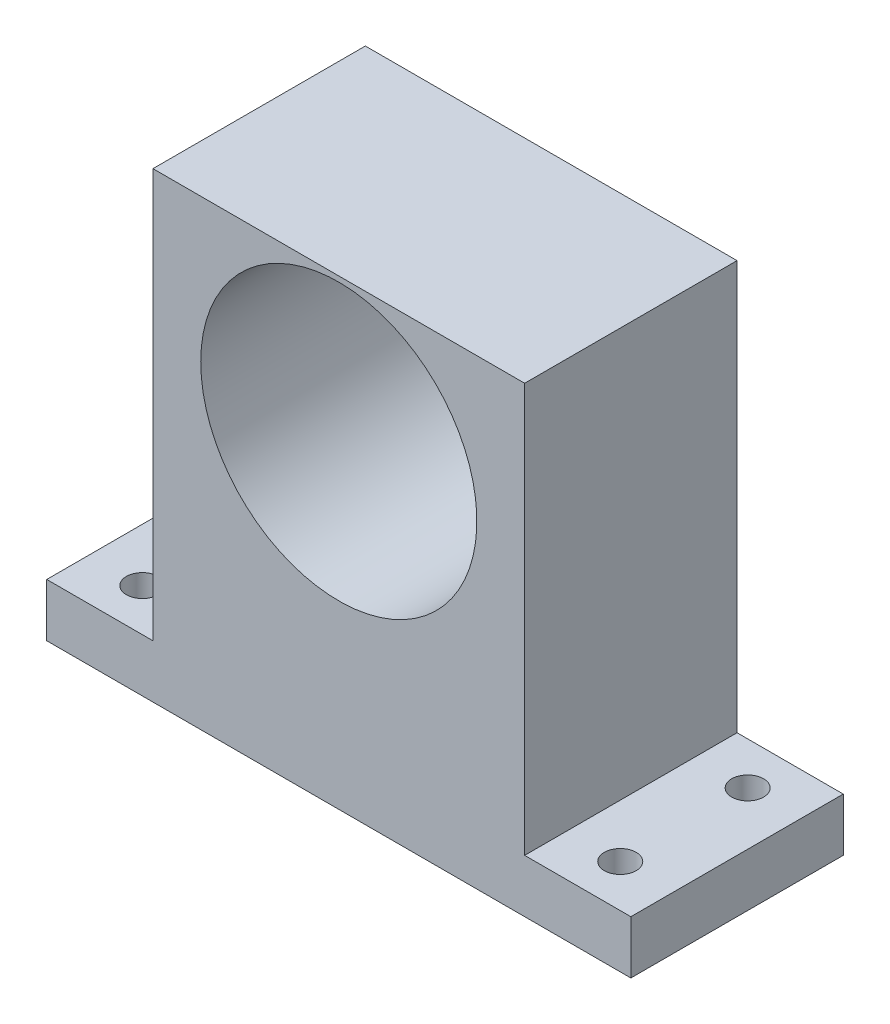
ISO-10303-21;
HEADER;
FILE_DESCRIPTION(('STEP AP214'),'2;1');
FILE_NAME('part.step','',(''),(''),'','','');
FILE_SCHEMA(('AUTOMOTIVE_DESIGN { 1 0 10303 214 1 1 1 1 }'));
ENDSEC;
DATA;
#1=APPLICATION_CONTEXT('core data for automotive mechanical design processes');
#2=APPLICATION_PROTOCOL_DEFINITION('international standard','automotive_design',2000,#1);
#3=PRODUCT_CONTEXT('',#1,'mechanical');
#4=PRODUCT('Part','Part','',(#3));
#5=PRODUCT_RELATED_PRODUCT_CATEGORY('part','',(#4));
#6=PRODUCT_DEFINITION_FORMATION('','',#4);
#7=PRODUCT_DEFINITION_CONTEXT('part definition',#1,'design');
#8=PRODUCT_DEFINITION('design','',#6,#7);
#9=PRODUCT_DEFINITION_SHAPE('','',#8);
#10=(LENGTH_UNIT() NAMED_UNIT(*) SI_UNIT(.MILLI.,.METRE.));
#11=(NAMED_UNIT(*) PLANE_ANGLE_UNIT() SI_UNIT($,.RADIAN.));
#12=(NAMED_UNIT(*) SI_UNIT($,.STERADIAN.) SOLID_ANGLE_UNIT());
#13=UNCERTAINTY_MEASURE_WITH_UNIT(LENGTH_MEASURE(1.E-05),#10,'distance_accuracy_value','');
#14=(GEOMETRIC_REPRESENTATION_CONTEXT(3) GLOBAL_UNCERTAINTY_ASSIGNED_CONTEXT((#13)) GLOBAL_UNIT_ASSIGNED_CONTEXT((#10,
#11,#12)) REPRESENTATION_CONTEXT('',''));
#15=CARTESIAN_POINT('',(0.,0.,0.));
#16=DIRECTION('',(0.,0.,1.));
#17=DIRECTION('',(1.,0.,0.));
#18=AXIS2_PLACEMENT_3D('',#15,#16,#17);
#19=CARTESIAN_POINT('',(-17.5,-21.75,20.));
#20=DIRECTION('',(1.,0.,0.));
#21=DIRECTION('',(0.,0.,-1.));
#22=AXIS2_PLACEMENT_3D('',#19,#20,#21);
#23=PLANE('',#22);
#24=DIRECTION('',(0.,0.,-1.));
#25=VECTOR('',#24,1.);
#26=CARTESIAN_POINT('',(-17.5,-16.75,0.));
#27=LINE('',#26,#25);
#28=CARTESIAN_POINT('',(-17.5,-16.75,20.));
#29=VERTEX_POINT('',#28);
#30=CARTESIAN_POINT('',(-17.5,-16.75,0.));
#31=VERTEX_POINT('',#30);
#32=EDGE_CURVE('E48',#29,#31,#27,.T.);
#33=ORIENTED_EDGE('',*,*,#32,.F.);
#34=DIRECTION('',(0.,-1.,0.));
#35=VECTOR('',#34,1.);
#36=CARTESIAN_POINT('',(-17.5,-21.75,20.));
#37=LINE('',#36,#35);
#38=CARTESIAN_POINT('',(-17.5,21.75,20.));
#39=VERTEX_POINT('',#38);
#40=EDGE_CURVE('E158',#39,#29,#37,.T.);
#41=ORIENTED_EDGE('',*,*,#40,.F.);
#42=DIRECTION('',(0.,0.,-1.));
#43=VECTOR('',#42,1.);
#44=CARTESIAN_POINT('',(-17.5,21.75,20.));
#45=LINE('',#44,#43);
#46=CARTESIAN_POINT('',(-17.5,21.75,0.));
#47=VERTEX_POINT('',#46);
#48=EDGE_CURVE('E41',#39,#47,#45,.T.);
#49=ORIENTED_EDGE('',*,*,#48,.T.);
#50=DIRECTION('',(0.,-1.,0.));
#51=VECTOR('',#50,1.);
#52=CARTESIAN_POINT('',(-17.5,-21.75,0.));
#53=LINE('',#52,#51);
#54=EDGE_CURVE('E111',#47,#31,#53,.T.);
#55=ORIENTED_EDGE('',*,*,#54,.T.);
#56=EDGE_LOOP('',(#33,#41,#49,#55));
#57=FACE_BOUND('',#56,.T.);
#58=ADVANCED_FACE('F33',(#57),#23,.F.);
#59=CARTESIAN_POINT('',(17.5,-21.75,20.));
#60=DIRECTION('',(-1.,0.,0.));
#61=DIRECTION('',(0.,0.,1.));
#62=AXIS2_PLACEMENT_3D('',#59,#60,#61);
#63=PLANE('',#62);
#64=DIRECTION('',(0.,0.,1.));
#65=VECTOR('',#64,1.);
#66=CARTESIAN_POINT('',(17.5,-16.75,20.));
#67=LINE('',#66,#65);
#68=CARTESIAN_POINT('',(17.5,-16.75,0.));
#69=VERTEX_POINT('',#68);
#70=CARTESIAN_POINT('',(17.5,-16.75,20.));
#71=VERTEX_POINT('',#70);
#72=EDGE_CURVE('E56',#69,#71,#67,.T.);
#73=ORIENTED_EDGE('',*,*,#72,.F.);
#74=DIRECTION('',(0.,1.,0.));
#75=VECTOR('',#74,1.);
#76=CARTESIAN_POINT('',(17.5,-21.75,0.));
#77=LINE('',#76,#75);
#78=CARTESIAN_POINT('',(17.5,21.75,0.));
#79=VERTEX_POINT('',#78);
#80=EDGE_CURVE('E154',#69,#79,#77,.T.);
#81=ORIENTED_EDGE('',*,*,#80,.T.);
#82=DIRECTION('',(0.,0.,-1.));
#83=VECTOR('',#82,1.);
#84=CARTESIAN_POINT('',(17.5,21.75,20.));
#85=LINE('',#84,#83);
#86=CARTESIAN_POINT('',(17.5,21.75,20.));
#87=VERTEX_POINT('',#86);
#88=EDGE_CURVE('E11',#87,#79,#85,.T.);
#89=ORIENTED_EDGE('',*,*,#88,.F.);
#90=DIRECTION('',(0.,1.,0.));
#91=VECTOR('',#90,1.);
#92=CARTESIAN_POINT('',(17.5,-21.75,20.));
#93=LINE('',#92,#91);
#94=EDGE_CURVE('E110',#71,#87,#93,.T.);
#95=ORIENTED_EDGE('',*,*,#94,.F.);
#96=EDGE_LOOP('',(#73,#81,#89,#95));
#97=FACE_BOUND('',#96,.T.);
#98=ADVANCED_FACE('F35',(#97),#63,.F.);
#99=CARTESIAN_POINT('',(-17.5,21.75,20.));
#100=DIRECTION('',(0.,-1.,0.));
#101=DIRECTION('',(0.,0.,-1.));
#102=AXIS2_PLACEMENT_3D('',#99,#100,#101);
#103=PLANE('',#102);
#104=DIRECTION('',(-1.,0.,0.));
#105=VECTOR('',#104,1.);
#106=CARTESIAN_POINT('',(-17.5,21.75,0.));
#107=LINE('',#106,#105);
#108=EDGE_CURVE('E162',#79,#47,#107,.T.);
#109=ORIENTED_EDGE('',*,*,#108,.T.);
#110=ORIENTED_EDGE('',*,*,#48,.F.);
#111=DIRECTION('',(-1.,0.,0.));
#112=VECTOR('',#111,1.);
#113=CARTESIAN_POINT('',(-17.5,21.75,20.));
#114=LINE('',#113,#112);
#115=EDGE_CURVE('E156',#87,#39,#114,.T.);
#116=ORIENTED_EDGE('',*,*,#115,.F.);
#117=ORIENTED_EDGE('',*,*,#88,.T.);
#118=EDGE_LOOP('',(#109,#110,#116,#117));
#119=FACE_BOUND('',#118,.T.);
#120=ADVANCED_FACE('F176',(#119),#103,.F.);
#121=CARTESIAN_POINT('',(-17.5,-21.75,20.));
#122=DIRECTION('',(0.,1.,0.));
#123=DIRECTION('',(0.,0.,1.));
#124=AXIS2_PLACEMENT_3D('',#121,#122,#123);
#125=PLANE('',#124);
#126=CARTESIAN_POINT('',(-22.5,-21.75,4.));
#127=DIRECTION('',(0.,1.,0.));
#128=DIRECTION('',(0.,0.,1.));
#129=AXIS2_PLACEMENT_3D('',#126,#127,#128);
#130=CIRCLE('',#129,1.5);
#131=CARTESIAN_POINT('',(-22.5,-21.75,5.5));
#132=VERTEX_POINT('',#131);
#133=EDGE_CURVE('E214',#132,#132,#130,.T.);
#134=ORIENTED_EDGE('',*,*,#133,.T.);
#135=EDGE_LOOP('',(#134));
#136=FACE_BOUND('',#135,.T.);
#137=CARTESIAN_POINT('',(22.5,-21.75,16.));
#138=DIRECTION('',(0.,1.,0.));
#139=DIRECTION('',(0.,0.,1.));
#140=AXIS2_PLACEMENT_3D('',#137,#138,#139);
#141=CIRCLE('',#140,1.5);
#142=CARTESIAN_POINT('',(22.5,-21.75,17.5));
#143=VERTEX_POINT('',#142);
#144=EDGE_CURVE('E218',#143,#143,#141,.T.);
#145=ORIENTED_EDGE('',*,*,#144,.T.);
#146=EDGE_LOOP('',(#145));
#147=FACE_BOUND('',#146,.T.);
#148=CARTESIAN_POINT('',(22.5,-21.75,4.));
#149=DIRECTION('',(0.,1.,0.));
#150=DIRECTION('',(0.,0.,1.));
#151=AXIS2_PLACEMENT_3D('',#148,#149,#150);
#152=CIRCLE('',#151,1.5);
#153=CARTESIAN_POINT('',(22.5,-21.75,5.5));
#154=VERTEX_POINT('',#153);
#155=EDGE_CURVE('E222',#154,#154,#152,.T.);
#156=ORIENTED_EDGE('',*,*,#155,.T.);
#157=EDGE_LOOP('',(#156));
#158=FACE_BOUND('',#157,.T.);
#159=CARTESIAN_POINT('',(-22.5,-21.75,16.));
#160=DIRECTION('',(0.,1.,0.));
#161=DIRECTION('',(0.,0.,1.));
#162=AXIS2_PLACEMENT_3D('',#159,#160,#161);
#163=CIRCLE('',#162,1.5);
#164=CARTESIAN_POINT('',(-22.5,-21.75,17.5));
#165=VERTEX_POINT('',#164);
#166=EDGE_CURVE('E126',#165,#165,#163,.T.);
#167=ORIENTED_EDGE('',*,*,#166,.T.);
#168=EDGE_LOOP('',(#167));
#169=FACE_BOUND('',#168,.T.);
#170=DIRECTION('',(1.,0.,0.));
#171=VECTOR('',#170,1.);
#172=CARTESIAN_POINT('',(-17.5,-21.75,0.));
#173=LINE('',#172,#171);
#174=CARTESIAN_POINT('',(-27.5,-21.75,0.));
#175=VERTEX_POINT('',#174);
#176=CARTESIAN_POINT('',(27.5,-21.75,0.));
#177=VERTEX_POINT('',#176);
#178=EDGE_CURVE('E99',#175,#177,#173,.T.);
#179=ORIENTED_EDGE('',*,*,#178,.T.);
#180=DIRECTION('',(0.,0.,-1.));
#181=VECTOR('',#180,1.);
#182=CARTESIAN_POINT('',(27.5,-21.75,20.));
#183=LINE('',#182,#181);
#184=CARTESIAN_POINT('',(27.5,-21.75,20.));
#185=VERTEX_POINT('',#184);
#186=EDGE_CURVE('E142',#185,#177,#183,.T.);
#187=ORIENTED_EDGE('',*,*,#186,.F.);
#188=DIRECTION('',(1.,0.,0.));
#189=VECTOR('',#188,1.);
#190=CARTESIAN_POINT('',(-17.5,-21.75,20.));
#191=LINE('',#190,#189);
#192=CARTESIAN_POINT('',(-27.5,-21.75,20.));
#193=VERTEX_POINT('',#192);
#194=EDGE_CURVE('E116',#193,#185,#191,.T.);
#195=ORIENTED_EDGE('',*,*,#194,.F.);
#196=DIRECTION('',(0.,0.,1.));
#197=VECTOR('',#196,1.);
#198=CARTESIAN_POINT('',(-27.5,-21.75,0.));
#199=LINE('',#198,#197);
#200=EDGE_CURVE('E114',#175,#193,#199,.T.);
#201=ORIENTED_EDGE('',*,*,#200,.F.);
#202=EDGE_LOOP('',(#179,#187,#195,#201));
#203=FACE_BOUND('',#202,.T.);
#204=ADVANCED_FACE('F115',(#136,#147,#158,#169,#203),#125,.F.);
#205=CARTESIAN_POINT('',(0.,0.,20.));
#206=DIRECTION('',(0.,0.,-1.));
#207=DIRECTION('',(-1.,0.,0.));
#208=AXIS2_PLACEMENT_3D('',#205,#206,#207);
#209=PLANE('',#208);
#210=CARTESIAN_POINT('',(0.,8.25,20.));
#211=DIRECTION('',(0.,0.,-1.));
#212=DIRECTION('',(-1.,0.,0.));
#213=AXIS2_PLACEMENT_3D('',#210,#211,#212);
#214=CIRCLE('',#213,13.);
#215=CARTESIAN_POINT('',(-13.,8.25,20.));
#216=VERTEX_POINT('',#215);
#217=EDGE_CURVE('E239',#216,#216,#214,.T.);
#218=ORIENTED_EDGE('',*,*,#217,.T.);
#219=EDGE_LOOP('',(#218));
#220=FACE_BOUND('',#219,.T.);
#221=ORIENTED_EDGE('',*,*,#194,.T.);
#222=DIRECTION('',(0.,-1.,0.));
#223=VECTOR('',#222,1.);
#224=CARTESIAN_POINT('',(27.5,-21.75,20.));
#225=LINE('',#224,#223);
#226=CARTESIAN_POINT('',(27.5,-16.75,20.));
#227=VERTEX_POINT('',#226);
#228=EDGE_CURVE('E139',#227,#185,#225,.T.);
#229=ORIENTED_EDGE('',*,*,#228,.F.);
#230=DIRECTION('',(-1.,0.,0.));
#231=VECTOR('',#230,1.);
#232=CARTESIAN_POINT('',(27.5,-16.75,20.));
#233=LINE('',#232,#231);
#234=EDGE_CURVE('E147',#227,#71,#233,.T.);
#235=ORIENTED_EDGE('',*,*,#234,.T.);
#236=ORIENTED_EDGE('',*,*,#94,.T.);
#237=ORIENTED_EDGE('',*,*,#115,.T.);
#238=ORIENTED_EDGE('',*,*,#40,.T.);
#239=DIRECTION('',(1.,0.,0.));
#240=VECTOR('',#239,1.);
#241=CARTESIAN_POINT('',(-27.5,-16.75,20.));
#242=LINE('',#241,#240);
#243=CARTESIAN_POINT('',(-27.5,-16.75,20.));
#244=VERTEX_POINT('',#243);
#245=EDGE_CURVE('E136',#244,#29,#242,.T.);
#246=ORIENTED_EDGE('',*,*,#245,.F.);
#247=DIRECTION('',(0.,1.,0.));
#248=VECTOR('',#247,1.);
#249=CARTESIAN_POINT('',(-27.5,-21.75,20.));
#250=LINE('',#249,#248);
#251=EDGE_CURVE('E119',#193,#244,#250,.T.);
#252=ORIENTED_EDGE('',*,*,#251,.F.);
#253=EDGE_LOOP('',(#221,#229,#235,#236,#237,#238,#246,#252));
#254=FACE_BOUND('',#253,.T.);
#255=ADVANCED_FACE('F174',(#220,#254),#209,.F.);
#256=CARTESIAN_POINT('',(0.,0.,0.));
#257=DIRECTION('',(0.,0.,-1.));
#258=DIRECTION('',(-1.,0.,0.));
#259=AXIS2_PLACEMENT_3D('',#256,#257,#258);
#260=PLANE('',#259);
#261=CARTESIAN_POINT('',(0.,8.25,0.));
#262=DIRECTION('',(0.,0.,-1.));
#263=DIRECTION('',(-1.,0.,0.));
#264=AXIS2_PLACEMENT_3D('',#261,#262,#263);
#265=CIRCLE('',#264,13.);
#266=CARTESIAN_POINT('',(-13.,8.25,0.));
#267=VERTEX_POINT('',#266);
#268=EDGE_CURVE('E241',#267,#267,#265,.T.);
#269=ORIENTED_EDGE('',*,*,#268,.F.);
#270=EDGE_LOOP('',(#269));
#271=FACE_BOUND('',#270,.T.);
#272=ORIENTED_EDGE('',*,*,#80,.F.);
#273=DIRECTION('',(-1.,0.,0.));
#274=VECTOR('',#273,1.);
#275=CARTESIAN_POINT('',(27.5,-16.75,0.));
#276=LINE('',#275,#274);
#277=CARTESIAN_POINT('',(27.5,-16.75,0.));
#278=VERTEX_POINT('',#277);
#279=EDGE_CURVE('E151',#278,#69,#276,.T.);
#280=ORIENTED_EDGE('',*,*,#279,.F.);
#281=DIRECTION('',(0.,1.,0.));
#282=VECTOR('',#281,1.);
#283=CARTESIAN_POINT('',(27.5,-21.75,0.));
#284=LINE('',#283,#282);
#285=EDGE_CURVE('E106',#177,#278,#284,.T.);
#286=ORIENTED_EDGE('',*,*,#285,.F.);
#287=ORIENTED_EDGE('',*,*,#178,.F.);
#288=DIRECTION('',(0.,-1.,0.));
#289=VECTOR('',#288,1.);
#290=CARTESIAN_POINT('',(-27.5,-21.75,0.));
#291=LINE('',#290,#289);
#292=CARTESIAN_POINT('',(-27.5,-16.75,0.));
#293=VERTEX_POINT('',#292);
#294=EDGE_CURVE('E104',#293,#175,#291,.T.);
#295=ORIENTED_EDGE('',*,*,#294,.F.);
#296=DIRECTION('',(1.,0.,0.));
#297=VECTOR('',#296,1.);
#298=CARTESIAN_POINT('',(-27.5,-16.75,0.));
#299=LINE('',#298,#297);
#300=EDGE_CURVE('E133',#293,#31,#299,.T.);
#301=ORIENTED_EDGE('',*,*,#300,.T.);
#302=ORIENTED_EDGE('',*,*,#54,.F.);
#303=ORIENTED_EDGE('',*,*,#108,.F.);
#304=EDGE_LOOP('',(#272,#280,#286,#287,#295,#301,#302,#303));
#305=FACE_BOUND('',#304,.T.);
#306=ADVANCED_FACE('F101',(#271,#305),#260,.T.);
#307=CARTESIAN_POINT('',(27.5,-16.75,20.));
#308=DIRECTION('',(0.,-1.,0.));
#309=DIRECTION('',(0.,0.,-1.));
#310=AXIS2_PLACEMENT_3D('',#307,#308,#309);
#311=PLANE('',#310);
#312=CARTESIAN_POINT('',(22.5,-16.75,16.));
#313=DIRECTION('',(0.,1.,0.));
#314=DIRECTION('',(0.,0.,1.));
#315=AXIS2_PLACEMENT_3D('',#312,#313,#314);
#316=CIRCLE('',#315,1.5);
#317=CARTESIAN_POINT('',(22.5,-16.75,17.5));
#318=VERTEX_POINT('',#317);
#319=EDGE_CURVE('E228',#318,#318,#316,.T.);
#320=ORIENTED_EDGE('',*,*,#319,.F.);
#321=EDGE_LOOP('',(#320));
#322=FACE_BOUND('',#321,.T.);
#323=CARTESIAN_POINT('',(22.5,-16.75,4.));
#324=DIRECTION('',(0.,1.,0.));
#325=DIRECTION('',(0.,0.,1.));
#326=AXIS2_PLACEMENT_3D('',#323,#324,#325);
#327=CIRCLE('',#326,1.5);
#328=CARTESIAN_POINT('',(22.5,-16.75,5.5));
#329=VERTEX_POINT('',#328);
#330=EDGE_CURVE('E236',#329,#329,#327,.T.);
#331=ORIENTED_EDGE('',*,*,#330,.F.);
#332=EDGE_LOOP('',(#331));
#333=FACE_BOUND('',#332,.T.);
#334=ORIENTED_EDGE('',*,*,#72,.T.);
#335=ORIENTED_EDGE('',*,*,#234,.F.);
#336=DIRECTION('',(0.,0.,1.));
#337=VECTOR('',#336,1.);
#338=CARTESIAN_POINT('',(27.5,-16.75,20.));
#339=LINE('',#338,#337);
#340=EDGE_CURVE('E145',#278,#227,#339,.T.);
#341=ORIENTED_EDGE('',*,*,#340,.F.);
#342=ORIENTED_EDGE('',*,*,#279,.T.);
#343=EDGE_LOOP('',(#334,#335,#341,#342));
#344=FACE_BOUND('',#343,.T.);
#345=ADVANCED_FACE('F179',(#322,#333,#344),#311,.F.);
#346=CARTESIAN_POINT('',(27.5,0.,0.));
#347=DIRECTION('',(-1.,0.,0.));
#348=DIRECTION('',(0.,0.,1.));
#349=AXIS2_PLACEMENT_3D('',#346,#347,#348);
#350=PLANE('',#349);
#351=ORIENTED_EDGE('',*,*,#228,.T.);
#352=ORIENTED_EDGE('',*,*,#186,.T.);
#353=ORIENTED_EDGE('',*,*,#285,.T.);
#354=ORIENTED_EDGE('',*,*,#340,.T.);
#355=EDGE_LOOP('',(#351,#352,#353,#354));
#356=FACE_BOUND('',#355,.T.);
#357=ADVANCED_FACE('F183',(#356),#350,.F.);
#358=CARTESIAN_POINT('',(-27.5,-16.75,0.));
#359=DIRECTION('',(0.,-1.,0.));
#360=DIRECTION('',(0.,0.,-1.));
#361=AXIS2_PLACEMENT_3D('',#358,#359,#360);
#362=PLANE('',#361);
#363=CARTESIAN_POINT('',(-22.5,-16.75,4.));
#364=DIRECTION('',(0.,1.,0.));
#365=DIRECTION('',(0.,0.,1.));
#366=AXIS2_PLACEMENT_3D('',#363,#364,#365);
#367=CIRCLE('',#366,1.5);
#368=CARTESIAN_POINT('',(-22.5,-16.75,5.5));
#369=VERTEX_POINT('',#368);
#370=EDGE_CURVE('E232',#369,#369,#367,.T.);
#371=ORIENTED_EDGE('',*,*,#370,.F.);
#372=EDGE_LOOP('',(#371));
#373=FACE_BOUND('',#372,.T.);
#374=CARTESIAN_POINT('',(-22.5,-16.75,16.));
#375=DIRECTION('',(0.,1.,0.));
#376=DIRECTION('',(0.,0.,1.));
#377=AXIS2_PLACEMENT_3D('',#374,#375,#376);
#378=CIRCLE('',#377,1.5);
#379=CARTESIAN_POINT('',(-22.5,-16.75,17.5));
#380=VERTEX_POINT('',#379);
#381=EDGE_CURVE('E129',#380,#380,#378,.T.);
#382=ORIENTED_EDGE('',*,*,#381,.F.);
#383=EDGE_LOOP('',(#382));
#384=FACE_BOUND('',#383,.T.);
#385=ORIENTED_EDGE('',*,*,#32,.T.);
#386=ORIENTED_EDGE('',*,*,#300,.F.);
#387=DIRECTION('',(0.,0.,-1.));
#388=VECTOR('',#387,1.);
#389=CARTESIAN_POINT('',(-27.5,-16.75,0.));
#390=LINE('',#389,#388);
#391=EDGE_CURVE('E123',#244,#293,#390,.T.);
#392=ORIENTED_EDGE('',*,*,#391,.F.);
#393=ORIENTED_EDGE('',*,*,#245,.T.);
#394=EDGE_LOOP('',(#385,#386,#392,#393));
#395=FACE_BOUND('',#394,.T.);
#396=ADVANCED_FACE('F171',(#373,#384,#395),#362,.F.);
#397=CARTESIAN_POINT('',(-27.5,0.,0.));
#398=DIRECTION('',(1.,0.,0.));
#399=DIRECTION('',(0.,0.,-1.));
#400=AXIS2_PLACEMENT_3D('',#397,#398,#399);
#401=PLANE('',#400);
#402=ORIENTED_EDGE('',*,*,#294,.T.);
#403=ORIENTED_EDGE('',*,*,#200,.T.);
#404=ORIENTED_EDGE('',*,*,#251,.T.);
#405=ORIENTED_EDGE('',*,*,#391,.T.);
#406=EDGE_LOOP('',(#402,#403,#404,#405));
#407=FACE_BOUND('',#406,.T.);
#408=ADVANCED_FACE('F121',(#407),#401,.F.);
#409=CARTESIAN_POINT('',(-22.5,-21.75,16.));
#410=DIRECTION('',(0.,1.,0.));
#411=DIRECTION('',(0.,0.,1.));
#412=AXIS2_PLACEMENT_3D('',#409,#410,#411);
#413=CYLINDRICAL_SURFACE('',#412,1.5);
#414=ORIENTED_EDGE('',*,*,#166,.F.);
#415=EDGE_LOOP('',(#414));
#416=FACE_BOUND('',#415,.T.);
#417=ORIENTED_EDGE('',*,*,#381,.T.);
#418=EDGE_LOOP('',(#417));
#419=FACE_BOUND('',#418,.T.);
#420=ADVANCED_FACE('F282',(#416,#419),#413,.F.);
#421=CARTESIAN_POINT('',(-22.5,-21.75,4.));
#422=DIRECTION('',(0.,1.,0.));
#423=DIRECTION('',(0.,0.,1.));
#424=AXIS2_PLACEMENT_3D('',#421,#422,#423);
#425=CYLINDRICAL_SURFACE('',#424,1.5);
#426=ORIENTED_EDGE('',*,*,#133,.F.);
#427=EDGE_LOOP('',(#426));
#428=FACE_BOUND('',#427,.T.);
#429=ORIENTED_EDGE('',*,*,#370,.T.);
#430=EDGE_LOOP('',(#429));
#431=FACE_BOUND('',#430,.T.);
#432=ADVANCED_FACE('F287',(#428,#431),#425,.F.);
#433=CARTESIAN_POINT('',(22.5,-21.75,4.));
#434=DIRECTION('',(0.,1.,0.));
#435=DIRECTION('',(0.,0.,1.));
#436=AXIS2_PLACEMENT_3D('',#433,#434,#435);
#437=CYLINDRICAL_SURFACE('',#436,1.5);
#438=ORIENTED_EDGE('',*,*,#155,.F.);
#439=EDGE_LOOP('',(#438));
#440=FACE_BOUND('',#439,.T.);
#441=ORIENTED_EDGE('',*,*,#330,.T.);
#442=EDGE_LOOP('',(#441));
#443=FACE_BOUND('',#442,.T.);
#444=ADVANCED_FACE('F296',(#440,#443),#437,.F.);
#445=CARTESIAN_POINT('',(22.5,-21.75,16.));
#446=DIRECTION('',(0.,1.,0.));
#447=DIRECTION('',(0.,0.,1.));
#448=AXIS2_PLACEMENT_3D('',#445,#446,#447);
#449=CYLINDRICAL_SURFACE('',#448,1.5);
#450=ORIENTED_EDGE('',*,*,#144,.F.);
#451=EDGE_LOOP('',(#450));
#452=FACE_BOUND('',#451,.T.);
#453=ORIENTED_EDGE('',*,*,#319,.T.);
#454=EDGE_LOOP('',(#453));
#455=FACE_BOUND('',#454,.T.);
#456=ADVANCED_FACE('F250',(#452,#455),#449,.F.);
#457=CARTESIAN_POINT('',(0.,8.25,20.));
#458=DIRECTION('',(0.,0.,-1.));
#459=DIRECTION('',(-1.,0.,0.));
#460=AXIS2_PLACEMENT_3D('',#457,#458,#459);
#461=CYLINDRICAL_SURFACE('',#460,13.);
#462=ORIENTED_EDGE('',*,*,#217,.F.);
#463=EDGE_LOOP('',(#462));
#464=FACE_BOUND('',#463,.T.);
#465=ORIENTED_EDGE('',*,*,#268,.T.);
#466=EDGE_LOOP('',(#465));
#467=FACE_BOUND('',#466,.T.);
#468=ADVANCED_FACE('F247',(#464,#467),#461,.F.);
#469=CLOSED_SHELL('',(#58,#98,#120,#204,#255,#306,#345,#357,#396,#408,#420,#432,#444,#456,#468));
#470=MANIFOLD_SOLID_BREP('B2',#469);
#471=ADVANCED_BREP_SHAPE_REPRESENTATION('',(#18,#470),#14);
#472=SHAPE_DEFINITION_REPRESENTATION(#9,#471);
ENDSEC;
END-ISO-10303-21;
